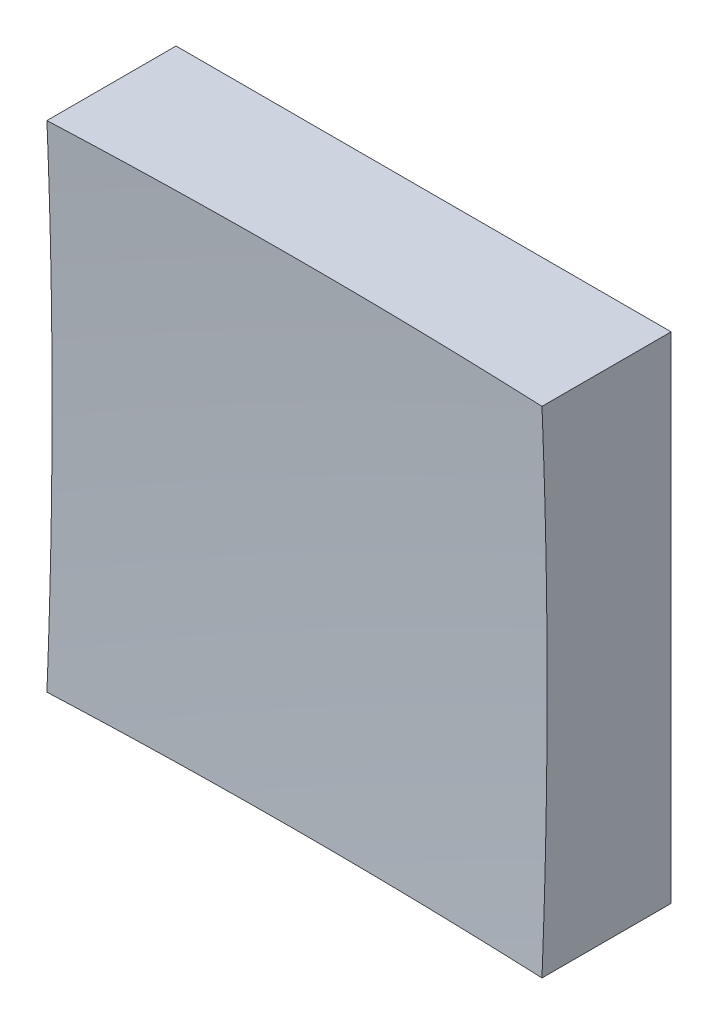
ISO-10303-21;
HEADER;
FILE_DESCRIPTION(('STEP AP214'),'2;1');
FILE_NAME('part.step','',(''),(''),'','','');
FILE_SCHEMA(('AUTOMOTIVE_DESIGN { 1 0 10303 214 1 1 1 1 }'));
ENDSEC;
DATA;
#1=APPLICATION_CONTEXT('core data for automotive mechanical design processes');
#2=APPLICATION_PROTOCOL_DEFINITION('international standard','automotive_design',2000,#1);
#3=PRODUCT_CONTEXT('',#1,'mechanical');
#4=PRODUCT('Part','Part','',(#3));
#5=PRODUCT_RELATED_PRODUCT_CATEGORY('part','',(#4));
#6=PRODUCT_DEFINITION_FORMATION('','',#4);
#7=PRODUCT_DEFINITION_CONTEXT('part definition',#1,'design');
#8=PRODUCT_DEFINITION('design','',#6,#7);
#9=PRODUCT_DEFINITION_SHAPE('','',#8);
#10=(LENGTH_UNIT() NAMED_UNIT(*) SI_UNIT(.MILLI.,.METRE.));
#11=(NAMED_UNIT(*) PLANE_ANGLE_UNIT() SI_UNIT($,.RADIAN.));
#12=(NAMED_UNIT(*) SI_UNIT($,.STERADIAN.) SOLID_ANGLE_UNIT());
#13=UNCERTAINTY_MEASURE_WITH_UNIT(LENGTH_MEASURE(1.E-05),#10,'distance_accuracy_value','');
#14=(GEOMETRIC_REPRESENTATION_CONTEXT(3) GLOBAL_UNCERTAINTY_ASSIGNED_CONTEXT((#13)) GLOBAL_UNIT_ASSIGNED_CONTEXT((#10,
#11,#12)) REPRESENTATION_CONTEXT('',''));
#15=CARTESIAN_POINT('',(0.,0.,0.));
#16=DIRECTION('',(0.,0.,1.));
#17=DIRECTION('',(1.,0.,0.));
#18=AXIS2_PLACEMENT_3D('',#15,#16,#17);
#19=CARTESIAN_POINT('',(-12.5,12.5,20.));
#20=DIRECTION('',(0.,1.,0.));
#21=DIRECTION('',(0.,0.,1.));
#22=AXIS2_PLACEMENT_3D('',#19,#20,#21);
#23=PLANE('',#22);
#24=CARTESIAN_POINT('',(0.,12.5,306.));
#25=DIRECTION('',(0.,1.,0.));
#26=DIRECTION('',(0.,0.,1.));
#27=AXIS2_PLACEMENT_3D('',#24,#25,#26);
#28=CIRCLE('',#27,299.739470207045);
#29=CARTESIAN_POINT('',(12.5,12.5,6.52128623222659));
#30=VERTEX_POINT('',#29);
#31=CARTESIAN_POINT('',(-12.5,12.5,6.52128623222659));
#32=VERTEX_POINT('',#31);
#33=EDGE_CURVE('E79',#30,#32,#28,.T.);
#34=ORIENTED_EDGE('',*,*,#33,.F.);
#35=DIRECTION('',(0.,0.,-1.));
#36=VECTOR('',#35,1.);
#37=CARTESIAN_POINT('',(12.5,12.5,20.));
#38=LINE('',#37,#36);
#39=CARTESIAN_POINT('',(12.5,12.5,0.));
#40=VERTEX_POINT('',#39);
#41=EDGE_CURVE('E85',#30,#40,#38,.T.);
#42=ORIENTED_EDGE('',*,*,#41,.T.);
#43=DIRECTION('',(1.,0.,0.));
#44=VECTOR('',#43,1.);
#45=CARTESIAN_POINT('',(-12.5,12.5,0.));
#46=LINE('',#45,#44);
#47=CARTESIAN_POINT('',(-12.5,12.5,0.));
#48=VERTEX_POINT('',#47);
#49=EDGE_CURVE('E88',#48,#40,#46,.T.);
#50=ORIENTED_EDGE('',*,*,#49,.F.);
#51=DIRECTION('',(0.,0.,-1.));
#52=VECTOR('',#51,1.);
#53=CARTESIAN_POINT('',(-12.5,12.5,20.));
#54=LINE('',#53,#52);
#55=EDGE_CURVE('E47',#32,#48,#54,.T.);
#56=ORIENTED_EDGE('',*,*,#55,.F.);
#57=EDGE_LOOP('',(#34,#42,#50,#56));
#58=FACE_BOUND('',#57,.T.);
#59=ADVANCED_FACE('F39',(#58),#23,.T.);
#60=CARTESIAN_POINT('',(-12.5,12.5,20.));
#61=DIRECTION('',(1.,0.,0.));
#62=DIRECTION('',(0.,1.,0.));
#63=AXIS2_PLACEMENT_3D('',#60,#61,#62);
#64=PLANE('',#63);
#65=DIRECTION('',(0.,0.,-1.));
#66=VECTOR('',#65,1.);
#67=CARTESIAN_POINT('',(-12.5,-12.5,20.));
#68=LINE('',#67,#66);
#69=CARTESIAN_POINT('',(-12.5,-12.5,6.52128623222659));
#70=VERTEX_POINT('',#69);
#71=CARTESIAN_POINT('',(-12.5,-12.5,0.));
#72=VERTEX_POINT('',#71);
#73=EDGE_CURVE('E100',#70,#72,#68,.T.);
#74=ORIENTED_EDGE('',*,*,#73,.F.);
#75=CARTESIAN_POINT('',(-12.5,0.,306.));
#76=DIRECTION('',(1.,0.,0.));
#77=DIRECTION('',(0.,1.,0.));
#78=AXIS2_PLACEMENT_3D('',#75,#76,#77);
#79=CIRCLE('',#78,299.739470207045);
#80=EDGE_CURVE('E89',#70,#32,#79,.T.);
#81=ORIENTED_EDGE('',*,*,#80,.T.);
#82=ORIENTED_EDGE('',*,*,#55,.T.);
#83=DIRECTION('',(0.,-1.,0.));
#84=VECTOR('',#83,1.);
#85=CARTESIAN_POINT('',(-12.5,12.5,0.));
#86=LINE('',#85,#84);
#87=EDGE_CURVE('E97',#48,#72,#86,.T.);
#88=ORIENTED_EDGE('',*,*,#87,.T.);
#89=EDGE_LOOP('',(#74,#81,#82,#88));
#90=FACE_BOUND('',#89,.T.);
#91=ADVANCED_FACE('F122',(#90),#64,.F.);
#92=CARTESIAN_POINT('',(-12.5,-12.5,20.));
#93=DIRECTION('',(0.,1.,0.));
#94=DIRECTION('',(0.,0.,1.));
#95=AXIS2_PLACEMENT_3D('',#92,#93,#94);
#96=PLANE('',#95);
#97=DIRECTION('',(0.,0.,-1.));
#98=VECTOR('',#97,1.);
#99=CARTESIAN_POINT('',(12.5,-12.5,20.));
#100=LINE('',#99,#98);
#101=CARTESIAN_POINT('',(12.5,-12.5,6.52128623222659));
#102=VERTEX_POINT('',#101);
#103=CARTESIAN_POINT('',(12.5,-12.5,0.));
#104=VERTEX_POINT('',#103);
#105=EDGE_CURVE('E96',#102,#104,#100,.T.);
#106=ORIENTED_EDGE('',*,*,#105,.F.);
#107=CARTESIAN_POINT('',(0.,-12.5,306.));
#108=DIRECTION('',(0.,1.,0.));
#109=DIRECTION('',(0.,0.,1.));
#110=AXIS2_PLACEMENT_3D('',#107,#108,#109);
#111=CIRCLE('',#110,299.739470207045);
#112=EDGE_CURVE('E53',#102,#70,#111,.T.);
#113=ORIENTED_EDGE('',*,*,#112,.T.);
#114=ORIENTED_EDGE('',*,*,#73,.T.);
#115=DIRECTION('',(1.,0.,0.));
#116=VECTOR('',#115,1.);
#117=CARTESIAN_POINT('',(-12.5,-12.5,0.));
#118=LINE('',#117,#116);
#119=EDGE_CURVE('E102',#72,#104,#118,.T.);
#120=ORIENTED_EDGE('',*,*,#119,.T.);
#121=EDGE_LOOP('',(#106,#113,#114,#120));
#122=FACE_BOUND('',#121,.T.);
#123=ADVANCED_FACE('F121',(#122),#96,.F.);
#124=CARTESIAN_POINT('',(12.5,12.5,20.));
#125=DIRECTION('',(1.,0.,0.));
#126=DIRECTION('',(0.,1.,0.));
#127=AXIS2_PLACEMENT_3D('',#124,#125,#126);
#128=PLANE('',#127);
#129=CARTESIAN_POINT('',(12.5,0.,306.));
#130=DIRECTION('',(1.,0.,0.));
#131=DIRECTION('',(0.,1.,0.));
#132=AXIS2_PLACEMENT_3D('',#129,#130,#131);
#133=CIRCLE('',#132,299.739470207045);
#134=EDGE_CURVE('E11',#102,#30,#133,.T.);
#135=ORIENTED_EDGE('',*,*,#134,.F.);
#136=ORIENTED_EDGE('',*,*,#105,.T.);
#137=DIRECTION('',(0.,-1.,0.));
#138=VECTOR('',#137,1.);
#139=CARTESIAN_POINT('',(12.5,12.5,0.));
#140=LINE('',#139,#138);
#141=EDGE_CURVE('E93',#40,#104,#140,.T.);
#142=ORIENTED_EDGE('',*,*,#141,.F.);
#143=ORIENTED_EDGE('',*,*,#41,.F.);
#144=EDGE_LOOP('',(#135,#136,#142,#143));
#145=FACE_BOUND('',#144,.T.);
#146=ADVANCED_FACE('F91',(#145),#128,.T.);
#147=CARTESIAN_POINT('',(0.,0.,0.));
#148=DIRECTION('',(0.,0.,-1.));
#149=DIRECTION('',(-1.,0.,0.));
#150=AXIS2_PLACEMENT_3D('',#147,#148,#149);
#151=PLANE('',#150);
#152=ORIENTED_EDGE('',*,*,#49,.T.);
#153=ORIENTED_EDGE('',*,*,#141,.T.);
#154=ORIENTED_EDGE('',*,*,#119,.F.);
#155=ORIENTED_EDGE('',*,*,#87,.F.);
#156=EDGE_LOOP('',(#152,#153,#154,#155));
#157=FACE_BOUND('',#156,.T.);
#158=ADVANCED_FACE('F125',(#157),#151,.T.);
#159=CARTESIAN_POINT('',(0.,0.,306.));
#160=DIRECTION('',(0.,0.,1.));
#161=DIRECTION('',(1.,0.,0.));
#162=AXIS2_PLACEMENT_3D('',#159,#160,#161);
#163=SPHERICAL_SURFACE('',#162,300.);
#164=ORIENTED_EDGE('',*,*,#33,.T.);
#165=ORIENTED_EDGE('',*,*,#80,.F.);
#166=ORIENTED_EDGE('',*,*,#112,.F.);
#167=ORIENTED_EDGE('',*,*,#134,.T.);
#168=EDGE_LOOP('',(#164,#165,#166,#167));
#169=FACE_BOUND('',#168,.T.);
#170=ADVANCED_FACE('F78',(#169),#163,.F.);
#171=CLOSED_SHELL('',(#59,#91,#123,#146,#158,#170));
#172=MANIFOLD_SOLID_BREP('B2',#171);
#173=ADVANCED_BREP_SHAPE_REPRESENTATION('',(#18,#172),#14);
#174=SHAPE_DEFINITION_REPRESENTATION(#9,#173);
ENDSEC;
END-ISO-10303-21;
